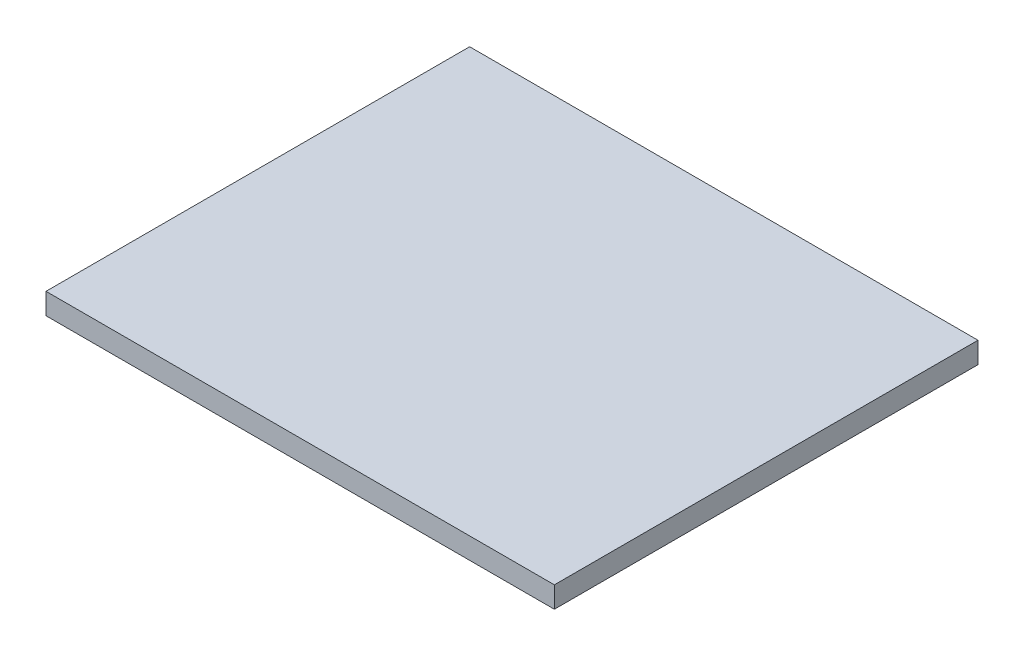
ISO-10303-21;
HEADER;
FILE_DESCRIPTION(('STEP AP214'),'2;1');
FILE_NAME('part.step','',(''),(''),'','','');
FILE_SCHEMA(('AUTOMOTIVE_DESIGN { 1 0 10303 214 1 1 1 1 }'));
ENDSEC;
DATA;
#1=APPLICATION_CONTEXT('core data for automotive mechanical design processes');
#2=APPLICATION_PROTOCOL_DEFINITION('international standard','automotive_design',2000,#1);
#3=PRODUCT_CONTEXT('',#1,'mechanical');
#4=PRODUCT('Part','Part','',(#3));
#5=PRODUCT_RELATED_PRODUCT_CATEGORY('part','',(#4));
#6=PRODUCT_DEFINITION_FORMATION('','',#4);
#7=PRODUCT_DEFINITION_CONTEXT('part definition',#1,'design');
#8=PRODUCT_DEFINITION('design','',#6,#7);
#9=PRODUCT_DEFINITION_SHAPE('','',#8);
#10=(LENGTH_UNIT() NAMED_UNIT(*) SI_UNIT(.MILLI.,.METRE.));
#11=(NAMED_UNIT(*) PLANE_ANGLE_UNIT() SI_UNIT($,.RADIAN.));
#12=(NAMED_UNIT(*) SI_UNIT($,.STERADIAN.) SOLID_ANGLE_UNIT());
#13=UNCERTAINTY_MEASURE_WITH_UNIT(LENGTH_MEASURE(1.E-05),#10,'distance_accuracy_value','');
#14=(GEOMETRIC_REPRESENTATION_CONTEXT(3) GLOBAL_UNCERTAINTY_ASSIGNED_CONTEXT((#13)) GLOBAL_UNIT_ASSIGNED_CONTEXT((#10,
#11,#12)) REPRESENTATION_CONTEXT('',''));
#15=CARTESIAN_POINT('',(0.,0.,0.));
#16=DIRECTION('',(0.,0.,1.));
#17=DIRECTION('',(1.,0.,0.));
#18=AXIS2_PLACEMENT_3D('',#15,#16,#17);
#19=CARTESIAN_POINT('',(76.2,6.35,63.5));
#20=DIRECTION('',(-1.,0.,0.));
#21=DIRECTION('',(0.,0.,1.));
#22=AXIS2_PLACEMENT_3D('',#19,#20,#21);
#23=PLANE('',#22);
#24=DIRECTION('',(0.,0.,-1.));
#25=VECTOR('',#24,1.);
#26=CARTESIAN_POINT('',(76.2,0.,63.5));
#27=LINE('',#26,#25);
#28=CARTESIAN_POINT('',(76.2,0.,63.5));
#29=VERTEX_POINT('',#28);
#30=CARTESIAN_POINT('',(76.2,0.,-63.5));
#31=VERTEX_POINT('',#30);
#32=EDGE_CURVE('E100',#29,#31,#27,.T.);
#33=ORIENTED_EDGE('',*,*,#32,.T.);
#34=DIRECTION('',(0.,-1.,0.));
#35=VECTOR('',#34,1.);
#36=CARTESIAN_POINT('',(76.2,6.35,-63.5));
#37=LINE('',#36,#35);
#38=CARTESIAN_POINT('',(76.2,6.35,-63.5));
#39=VERTEX_POINT('',#38);
#40=EDGE_CURVE('E11',#39,#31,#37,.T.);
#41=ORIENTED_EDGE('',*,*,#40,.F.);
#42=DIRECTION('',(0.,0.,-1.));
#43=VECTOR('',#42,1.);
#44=CARTESIAN_POINT('',(76.2,6.35,63.5));
#45=LINE('',#44,#43);
#46=CARTESIAN_POINT('',(76.2,6.35,63.5));
#47=VERTEX_POINT('',#46);
#48=EDGE_CURVE('E88',#47,#39,#45,.T.);
#49=ORIENTED_EDGE('',*,*,#48,.F.);
#50=DIRECTION('',(0.,-1.,0.));
#51=VECTOR('',#50,1.);
#52=CARTESIAN_POINT('',(76.2,6.35,63.5));
#53=LINE('',#52,#51);
#54=EDGE_CURVE('E96',#47,#29,#53,.T.);
#55=ORIENTED_EDGE('',*,*,#54,.T.);
#56=EDGE_LOOP('',(#33,#41,#49,#55));
#57=FACE_BOUND('',#56,.T.);
#58=ADVANCED_FACE('F37',(#57),#23,.F.);
#59=CARTESIAN_POINT('',(-76.2,6.35,-63.5));
#60=DIRECTION('',(0.,0.,1.));
#61=DIRECTION('',(1.,0.,0.));
#62=AXIS2_PLACEMENT_3D('',#59,#60,#61);
#63=PLANE('',#62);
#64=DIRECTION('',(-1.,0.,0.));
#65=VECTOR('',#64,1.);
#66=CARTESIAN_POINT('',(-76.2,0.,-63.5));
#67=LINE('',#66,#65);
#68=CARTESIAN_POINT('',(-76.2,0.,-63.5));
#69=VERTEX_POINT('',#68);
#70=EDGE_CURVE('E92',#31,#69,#67,.T.);
#71=ORIENTED_EDGE('',*,*,#70,.T.);
#72=DIRECTION('',(0.,-1.,0.));
#73=VECTOR('',#72,1.);
#74=CARTESIAN_POINT('',(-76.2,6.35,-63.5));
#75=LINE('',#74,#73);
#76=CARTESIAN_POINT('',(-76.2,6.35,-63.5));
#77=VERTEX_POINT('',#76);
#78=EDGE_CURVE('E45',#77,#69,#75,.T.);
#79=ORIENTED_EDGE('',*,*,#78,.F.);
#80=DIRECTION('',(-1.,0.,0.));
#81=VECTOR('',#80,1.);
#82=CARTESIAN_POINT('',(-76.2,6.35,-63.5));
#83=LINE('',#82,#81);
#84=EDGE_CURVE('E83',#39,#77,#83,.T.);
#85=ORIENTED_EDGE('',*,*,#84,.F.);
#86=ORIENTED_EDGE('',*,*,#40,.T.);
#87=EDGE_LOOP('',(#71,#79,#85,#86));
#88=FACE_BOUND('',#87,.T.);
#89=ADVANCED_FACE('F91',(#88),#63,.F.);
#90=CARTESIAN_POINT('',(-76.2,6.35,63.5));
#91=DIRECTION('',(1.,0.,0.));
#92=DIRECTION('',(0.,0.,-1.));
#93=AXIS2_PLACEMENT_3D('',#90,#91,#92);
#94=PLANE('',#93);
#95=DIRECTION('',(0.,0.,1.));
#96=VECTOR('',#95,1.);
#97=CARTESIAN_POINT('',(-76.2,0.,63.5));
#98=LINE('',#97,#96);
#99=CARTESIAN_POINT('',(-76.2,0.,63.5));
#100=VERTEX_POINT('',#99);
#101=EDGE_CURVE('E70',#69,#100,#98,.T.);
#102=ORIENTED_EDGE('',*,*,#101,.T.);
#103=DIRECTION('',(0.,-1.,0.));
#104=VECTOR('',#103,1.);
#105=CARTESIAN_POINT('',(-76.2,6.35,63.5));
#106=LINE('',#105,#104);
#107=CARTESIAN_POINT('',(-76.2,6.35,63.5));
#108=VERTEX_POINT('',#107);
#109=EDGE_CURVE('E93',#108,#100,#106,.T.);
#110=ORIENTED_EDGE('',*,*,#109,.F.);
#111=DIRECTION('',(0.,0.,1.));
#112=VECTOR('',#111,1.);
#113=CARTESIAN_POINT('',(-76.2,6.35,63.5));
#114=LINE('',#113,#112);
#115=EDGE_CURVE('E86',#77,#108,#114,.T.);
#116=ORIENTED_EDGE('',*,*,#115,.F.);
#117=ORIENTED_EDGE('',*,*,#78,.T.);
#118=EDGE_LOOP('',(#102,#110,#116,#117));
#119=FACE_BOUND('',#118,.T.);
#120=ADVANCED_FACE('F94',(#119),#94,.F.);
#121=CARTESIAN_POINT('',(-76.2,6.35,63.5));
#122=DIRECTION('',(0.,0.,-1.));
#123=DIRECTION('',(-1.,0.,0.));
#124=AXIS2_PLACEMENT_3D('',#121,#122,#123);
#125=PLANE('',#124);
#126=DIRECTION('',(1.,0.,0.));
#127=VECTOR('',#126,1.);
#128=CARTESIAN_POINT('',(-76.2,0.,63.5));
#129=LINE('',#128,#127);
#130=EDGE_CURVE('E76',#100,#29,#129,.T.);
#131=ORIENTED_EDGE('',*,*,#130,.T.);
#132=ORIENTED_EDGE('',*,*,#54,.F.);
#133=DIRECTION('',(1.,0.,0.));
#134=VECTOR('',#133,1.);
#135=CARTESIAN_POINT('',(-76.2,6.35,63.5));
#136=LINE('',#135,#134);
#137=EDGE_CURVE('E53',#108,#47,#136,.T.);
#138=ORIENTED_EDGE('',*,*,#137,.F.);
#139=ORIENTED_EDGE('',*,*,#109,.T.);
#140=EDGE_LOOP('',(#131,#132,#138,#139));
#141=FACE_BOUND('',#140,.T.);
#142=ADVANCED_FACE('F107',(#141),#125,.F.);
#143=CARTESIAN_POINT('',(0.,6.35,0.));
#144=DIRECTION('',(0.,-1.,0.));
#145=DIRECTION('',(0.,0.,-1.));
#146=AXIS2_PLACEMENT_3D('',#143,#144,#145);
#147=PLANE('',#146);
#148=ORIENTED_EDGE('',*,*,#48,.T.);
#149=ORIENTED_EDGE('',*,*,#84,.T.);
#150=ORIENTED_EDGE('',*,*,#115,.T.);
#151=ORIENTED_EDGE('',*,*,#137,.T.);
#152=EDGE_LOOP('',(#148,#149,#150,#151));
#153=FACE_BOUND('',#152,.T.);
#154=ADVANCED_FACE('F84',(#153),#147,.F.);
#155=CARTESIAN_POINT('',(0.,0.,0.));
#156=DIRECTION('',(0.,-1.,0.));
#157=DIRECTION('',(0.,0.,-1.));
#158=AXIS2_PLACEMENT_3D('',#155,#156,#157);
#159=PLANE('',#158);
#160=ORIENTED_EDGE('',*,*,#32,.F.);
#161=ORIENTED_EDGE('',*,*,#130,.F.);
#162=ORIENTED_EDGE('',*,*,#101,.F.);
#163=ORIENTED_EDGE('',*,*,#70,.F.);
#164=EDGE_LOOP('',(#160,#161,#162,#163));
#165=FACE_BOUND('',#164,.T.);
#166=ADVANCED_FACE('F110',(#165),#159,.T.);
#167=CLOSED_SHELL('',(#58,#89,#120,#142,#154,#166));
#168=MANIFOLD_SOLID_BREP('B2',#167);
#169=ADVANCED_BREP_SHAPE_REPRESENTATION('',(#18,#168),#14);
#170=SHAPE_DEFINITION_REPRESENTATION(#9,#169);
ENDSEC;
END-ISO-10303-21;
